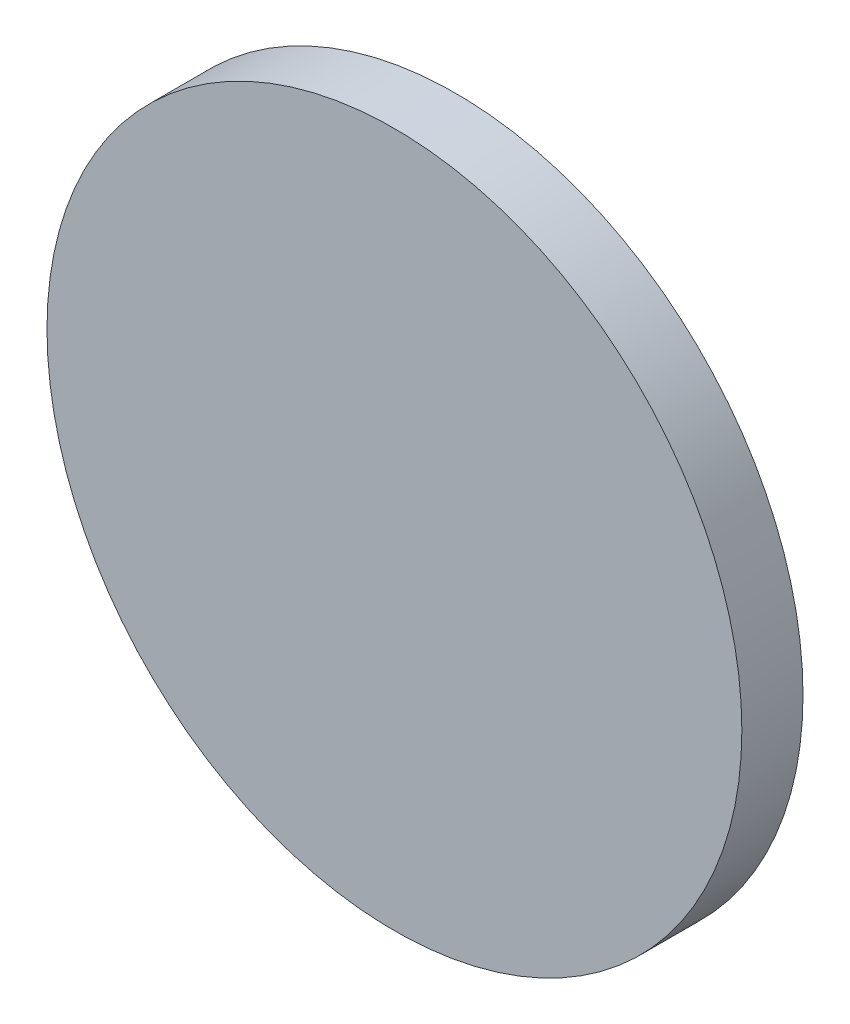
ISO-10303-21;
HEADER;
FILE_DESCRIPTION(('STEP AP214'),'2;1');
FILE_NAME('part.step','',(''),(''),'','','');
FILE_SCHEMA(('AUTOMOTIVE_DESIGN { 1 0 10303 214 1 1 1 1 }'));
ENDSEC;
DATA;
#1=APPLICATION_CONTEXT('core data for automotive mechanical design processes');
#2=APPLICATION_PROTOCOL_DEFINITION('international standard','automotive_design',2000,#1);
#3=PRODUCT_CONTEXT('',#1,'mechanical');
#4=PRODUCT('Part','Part','',(#3));
#5=PRODUCT_RELATED_PRODUCT_CATEGORY('part','',(#4));
#6=PRODUCT_DEFINITION_FORMATION('','',#4);
#7=PRODUCT_DEFINITION_CONTEXT('part definition',#1,'design');
#8=PRODUCT_DEFINITION('design','',#6,#7);
#9=PRODUCT_DEFINITION_SHAPE('','',#8);
#10=(LENGTH_UNIT() NAMED_UNIT(*) SI_UNIT(.MILLI.,.METRE.));
#11=(NAMED_UNIT(*) PLANE_ANGLE_UNIT() SI_UNIT($,.RADIAN.));
#12=(NAMED_UNIT(*) SI_UNIT($,.STERADIAN.) SOLID_ANGLE_UNIT());
#13=UNCERTAINTY_MEASURE_WITH_UNIT(LENGTH_MEASURE(1.E-05),#10,'distance_accuracy_value','');
#14=(GEOMETRIC_REPRESENTATION_CONTEXT(3) GLOBAL_UNCERTAINTY_ASSIGNED_CONTEXT((#13)) GLOBAL_UNIT_ASSIGNED_CONTEXT((#10,
#11,#12)) REPRESENTATION_CONTEXT('',''));
#15=CARTESIAN_POINT('',(0.,0.,0.));
#16=DIRECTION('',(0.,0.,1.));
#17=DIRECTION('',(1.,0.,0.));
#18=AXIS2_PLACEMENT_3D('',#15,#16,#17);
#19=CARTESIAN_POINT('',(0.,0.,1.1));
#20=DIRECTION('',(0.,0.,-1.));
#21=DIRECTION('',(-1.,0.,0.));
#22=AXIS2_PLACEMENT_3D('',#19,#20,#21);
#23=CYLINDRICAL_SURFACE('',#22,6.25);
#24=CARTESIAN_POINT('',(0.,0.,1.1));
#25=DIRECTION('',(0.,0.,1.));
#26=DIRECTION('',(1.,0.,0.));
#27=AXIS2_PLACEMENT_3D('',#24,#25,#26);
#28=CIRCLE('',#27,6.25);
#29=CARTESIAN_POINT('',(6.25,0.,1.1));
#30=VERTEX_POINT('',#29);
#31=EDGE_CURVE('E10',#30,#30,#28,.T.);
#32=ORIENTED_EDGE('',*,*,#31,.F.);
#33=EDGE_LOOP('',(#32));
#34=FACE_BOUND('',#33,.T.);
#35=CARTESIAN_POINT('',(0.,0.,0.));
#36=DIRECTION('',(0.,0.,1.));
#37=DIRECTION('',(1.,0.,0.));
#38=AXIS2_PLACEMENT_3D('',#35,#36,#37);
#39=CIRCLE('',#38,6.25);
#40=CARTESIAN_POINT('',(6.25,0.,0.));
#41=VERTEX_POINT('',#40);
#42=EDGE_CURVE('E36',#41,#41,#39,.T.);
#43=ORIENTED_EDGE('',*,*,#42,.T.);
#44=EDGE_LOOP('',(#43));
#45=FACE_BOUND('',#44,.T.);
#46=ADVANCED_FACE('F33',(#34,#45),#23,.T.);
#47=CARTESIAN_POINT('',(0.,0.,1.1));
#48=DIRECTION('',(0.,0.,1.));
#49=DIRECTION('',(1.,0.,0.));
#50=AXIS2_PLACEMENT_3D('',#47,#48,#49);
#51=PLANE('',#50);
#52=ORIENTED_EDGE('',*,*,#31,.T.);
#53=EDGE_LOOP('',(#52));
#54=FACE_BOUND('',#53,.T.);
#55=ADVANCED_FACE('F48',(#54),#51,.T.);
#56=CARTESIAN_POINT('',(0.,0.,0.));
#57=DIRECTION('',(0.,0.,1.));
#58=DIRECTION('',(1.,0.,0.));
#59=AXIS2_PLACEMENT_3D('',#56,#57,#58);
#60=PLANE('',#59);
#61=ORIENTED_EDGE('',*,*,#42,.F.);
#62=EDGE_LOOP('',(#61));
#63=FACE_BOUND('',#62,.T.);
#64=ADVANCED_FACE('F46',(#63),#60,.F.);
#65=CLOSED_SHELL('',(#46,#55,#64));
#66=MANIFOLD_SOLID_BREP('B2',#65);
#67=ADVANCED_BREP_SHAPE_REPRESENTATION('',(#18,#66),#14);
#68=SHAPE_DEFINITION_REPRESENTATION(#9,#67);
ENDSEC;
END-ISO-10303-21;
